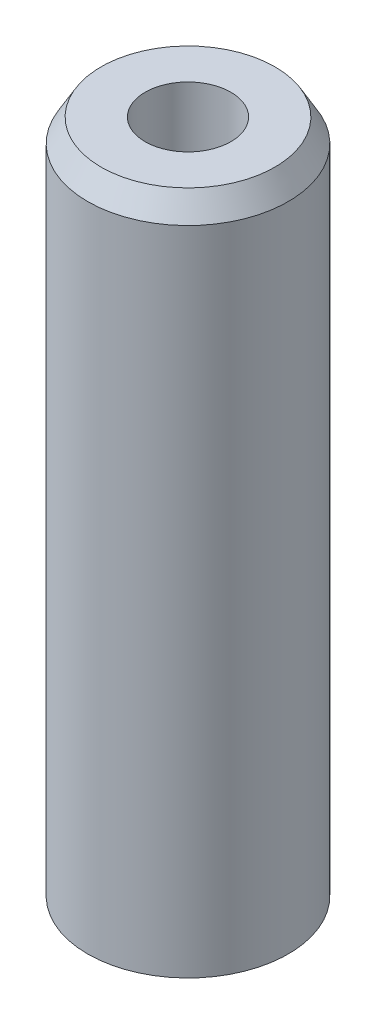
ISO-10303-21;
HEADER;
FILE_DESCRIPTION(('STEP AP214'),'2;1');
FILE_NAME('part.step','',(''),(''),'','','');
FILE_SCHEMA(('AUTOMOTIVE_DESIGN { 1 0 10303 214 1 1 1 1 }'));
ENDSEC;
DATA;
#1=APPLICATION_CONTEXT('core data for automotive mechanical design processes');
#2=APPLICATION_PROTOCOL_DEFINITION('international standard','automotive_design',2000,#1);
#3=PRODUCT_CONTEXT('',#1,'mechanical');
#4=PRODUCT('Part','Part','',(#3));
#5=PRODUCT_RELATED_PRODUCT_CATEGORY('part','',(#4));
#6=PRODUCT_DEFINITION_FORMATION('','',#4);
#7=PRODUCT_DEFINITION_CONTEXT('part definition',#1,'design');
#8=PRODUCT_DEFINITION('design','',#6,#7);
#9=PRODUCT_DEFINITION_SHAPE('','',#8);
#10=(LENGTH_UNIT() NAMED_UNIT(*) SI_UNIT(.MILLI.,.METRE.));
#11=(NAMED_UNIT(*) PLANE_ANGLE_UNIT() SI_UNIT($,.RADIAN.));
#12=(NAMED_UNIT(*) SI_UNIT($,.STERADIAN.) SOLID_ANGLE_UNIT());
#13=UNCERTAINTY_MEASURE_WITH_UNIT(LENGTH_MEASURE(1.E-05),#10,'distance_accuracy_value','');
#14=(GEOMETRIC_REPRESENTATION_CONTEXT(3) GLOBAL_UNCERTAINTY_ASSIGNED_CONTEXT((#13)) GLOBAL_UNIT_ASSIGNED_CONTEXT((#10,
#11,#12)) REPRESENTATION_CONTEXT('',''));
#15=CARTESIAN_POINT('',(0.,0.,0.));
#16=DIRECTION('',(0.,0.,1.));
#17=DIRECTION('',(1.,0.,0.));
#18=AXIS2_PLACEMENT_3D('',#15,#16,#17);
#19=CARTESIAN_POINT('',(0.,68.6098912815722,0.));
#20=DIRECTION('',(0.,-1.,0.));
#21=DIRECTION('',(0.,0.,-1.));
#22=AXIS2_PLACEMENT_3D('',#19,#20,#21);
#23=CYLINDRICAL_SURFACE('',#22,10.);
#24=CARTESIAN_POINT('',(0.,66.3017269703377,0.));
#25=DIRECTION('',(0.,1.,0.));
#26=DIRECTION('',(0.,0.,1.));
#27=AXIS2_PLACEMENT_3D('',#24,#25,#26);
#28=CIRCLE('',#27,10.);
#29=CARTESIAN_POINT('',(0.,66.3017269703377,10.));
#30=VERTEX_POINT('',#29);
#31=EDGE_CURVE('E50',#30,#30,#28,.F.);
#32=ORIENTED_EDGE('',*,*,#31,.T.);
#33=EDGE_LOOP('',(#32));
#34=FACE_BOUND('',#33,.T.);
#35=CARTESIAN_POINT('',(0.,1.33261928642511,0.));
#36=DIRECTION('',(0.,1.,0.));
#37=DIRECTION('',(0.,0.,1.));
#38=AXIS2_PLACEMENT_3D('',#35,#36,#37);
#39=CIRCLE('',#38,10.);
#40=CARTESIAN_POINT('',(0.,1.33261928642511,10.));
#41=VERTEX_POINT('',#40);
#42=EDGE_CURVE('E51',#41,#41,#39,.T.);
#43=ORIENTED_EDGE('',*,*,#42,.T.);
#44=EDGE_LOOP('',(#43));
#45=FACE_BOUND('',#44,.T.);
#46=ADVANCED_FACE('F39',(#34,#45),#23,.T.);
#47=CARTESIAN_POINT('',(0.,68.6098912815722,0.));
#48=DIRECTION('',(0.,1.,0.));
#49=DIRECTION('',(0.,0.,1.));
#50=AXIS2_PLACEMENT_3D('',#47,#48,#49);
#51=PLANE('',#50);
#52=CARTESIAN_POINT('',(0.,68.6098912815722,0.));
#53=DIRECTION('',(0.,1.,0.));
#54=DIRECTION('',(0.,0.,1.));
#55=AXIS2_PLACEMENT_3D('',#52,#53,#54);
#56=CIRCLE('',#55,8.66738071357488);
#57=CARTESIAN_POINT('',(0.,68.6098912815722,8.66738071357488));
#58=VERTEX_POINT('',#57);
#59=EDGE_CURVE('E54',#58,#58,#56,.T.);
#60=ORIENTED_EDGE('',*,*,#59,.T.);
#61=EDGE_LOOP('',(#60));
#62=FACE_BOUND('',#61,.T.);
#63=CARTESIAN_POINT('',(0.,68.6098912815722,0.));
#64=DIRECTION('',(0.,1.,0.));
#65=DIRECTION('',(0.,0.,1.));
#66=AXIS2_PLACEMENT_3D('',#63,#64,#65);
#67=CIRCLE('',#66,4.27527601353929);
#68=CARTESIAN_POINT('',(0.,68.6098912815722,4.27527601353929));
#69=VERTEX_POINT('',#68);
#70=EDGE_CURVE('E58',#69,#69,#67,.T.);
#71=ORIENTED_EDGE('',*,*,#70,.F.);
#72=EDGE_LOOP('',(#71));
#73=FACE_BOUND('',#72,.T.);
#74=ADVANCED_FACE('F69',(#62,#73),#51,.T.);
#75=CARTESIAN_POINT('',(0.,0.,0.));
#76=DIRECTION('',(0.,1.,0.));
#77=DIRECTION('',(0.,0.,1.));
#78=AXIS2_PLACEMENT_3D('',#75,#76,#77);
#79=PLANE('',#78);
#80=CARTESIAN_POINT('',(0.,0.,0.));
#81=DIRECTION('',(0.,1.,0.));
#82=DIRECTION('',(0.,0.,1.));
#83=AXIS2_PLACEMENT_3D('',#80,#81,#82);
#84=CIRCLE('',#83,7.69183568876549);
#85=CARTESIAN_POINT('',(0.,0.,7.69183568876549));
#86=VERTEX_POINT('',#85);
#87=EDGE_CURVE('E10',#86,#86,#84,.F.);
#88=ORIENTED_EDGE('',*,*,#87,.T.);
#89=EDGE_LOOP('',(#88));
#90=FACE_BOUND('',#89,.T.);
#91=CARTESIAN_POINT('',(0.,0.,0.));
#92=DIRECTION('',(0.,1.,0.));
#93=DIRECTION('',(0.,0.,1.));
#94=AXIS2_PLACEMENT_3D('',#91,#92,#93);
#95=CIRCLE('',#94,4.27527601353929);
#96=CARTESIAN_POINT('',(0.,0.,4.27527601353929));
#97=VERTEX_POINT('',#96);
#98=EDGE_CURVE('E63',#97,#97,#95,.T.);
#99=ORIENTED_EDGE('',*,*,#98,.T.);
#100=EDGE_LOOP('',(#99));
#101=FACE_BOUND('',#100,.T.);
#102=ADVANCED_FACE('F75',(#90,#101),#79,.F.);
#103=CARTESIAN_POINT('',(0.,68.6098912815722,0.));
#104=DIRECTION('',(0.,-1.,0.));
#105=DIRECTION('',(0.,0.,-1.));
#106=AXIS2_PLACEMENT_3D('',#103,#104,#105);
#107=CYLINDRICAL_SURFACE('',#106,4.27527601353929);
#108=ORIENTED_EDGE('',*,*,#70,.T.);
#109=EDGE_LOOP('',(#108));
#110=FACE_BOUND('',#109,.T.);
#111=ORIENTED_EDGE('',*,*,#98,.F.);
#112=EDGE_LOOP('',(#111));
#113=FACE_BOUND('',#112,.T.);
#114=ADVANCED_FACE('F70',(#110,#113),#107,.F.);
#115=CARTESIAN_POINT('',(0.,68.6098912815722,0.));
#116=DIRECTION('',(0.,-1.,0.));
#117=DIRECTION('',(0.,0.,-1.));
#118=AXIS2_PLACEMENT_3D('',#115,#116,#117);
#119=CONICAL_SURFACE('',#118,8.66738071357488,0.523598775598294);
#120=ORIENTED_EDGE('',*,*,#31,.F.);
#121=EDGE_LOOP('',(#120));
#122=FACE_BOUND('',#121,.T.);
#123=ORIENTED_EDGE('',*,*,#59,.F.);
#124=EDGE_LOOP('',(#123));
#125=FACE_BOUND('',#124,.T.);
#126=ADVANCED_FACE('F81',(#122,#125),#119,.T.);
#127=CARTESIAN_POINT('',(0.,1.33261928642511,0.));
#128=DIRECTION('',(0.,1.,0.));
#129=DIRECTION('',(0.,0.,1.));
#130=AXIS2_PLACEMENT_3D('',#127,#128,#129);
#131=CONICAL_SURFACE('',#130,10.,1.0471975511966);
#132=CARTESIAN_POINT('',(0.,0.,7.69183568876549));
#133=CARTESIAN_POINT('',(0.,0.0138814509002611,7.71587906700752));
#134=CARTESIAN_POINT('',(0.,0.0277629018005228,7.73992244524954));
#135=CARTESIAN_POINT('',(0.,0.0555258036010462,7.78800920173359));
#136=CARTESIAN_POINT('',(0.,0.0694072545013079,7.81205257997562));
#137=CARTESIAN_POINT('',(0.,0.0971701563018311,7.86013933645967));
#138=CARTESIAN_POINT('',(0.,0.111051607202093,7.8841827147017));
#139=CARTESIAN_POINT('',(0.,0.138814509002616,7.93226947118575));
#140=CARTESIAN_POINT('',(0.,0.152695959902877,7.95631284942778));
#141=CARTESIAN_POINT('',(0.,0.1804588617034,8.00439960591183));
#142=CARTESIAN_POINT('',(0.,0.194340312603662,8.02844298415386));
#143=CARTESIAN_POINT('',(0.,0.222103214404185,8.07652974063791));
#144=CARTESIAN_POINT('',(0.,0.235984665304447,8.10057311887993));
#145=CARTESIAN_POINT('',(0.,0.26374756710497,8.14865987536399));
#146=CARTESIAN_POINT('',(0.,0.277629018005232,8.17270325360601));
#147=CARTESIAN_POINT('',(0.,0.305391919805755,8.22079001009006));
#148=CARTESIAN_POINT('',(0.,0.319273370706017,8.24483338833209));
#149=CARTESIAN_POINT('',(0.,0.34703627250654,8.29292014481614));
#150=CARTESIAN_POINT('',(0.,0.360917723406801,8.31696352305817));
#151=CARTESIAN_POINT('',(0.,0.388680625207324,8.36505027954222));
#152=CARTESIAN_POINT('',(0.,0.402562076107586,8.38909365778425));
#153=CARTESIAN_POINT('',(0.,0.430324977908109,8.4371804142683));
#154=CARTESIAN_POINT('',(0.,0.444206428808371,8.46122379251033));
#155=CARTESIAN_POINT('',(0.,0.471969330608894,8.50931054899438));
#156=CARTESIAN_POINT('',(0.,0.485850781509156,8.5333539272364));
#157=CARTESIAN_POINT('',(0.,0.513613683309679,8.58144068372046));
#158=CARTESIAN_POINT('',(0.,0.52749513420994,8.60548406196248));
#159=CARTESIAN_POINT('',(0.,0.555258036010464,8.65357081844654));
#160=CARTESIAN_POINT('',(0.,0.569139486910725,8.67761419668856));
#161=CARTESIAN_POINT('',(0.,0.596902388711249,8.72570095317261));
#162=CARTESIAN_POINT('',(0.,0.61078383961151,8.74974433141464));
#163=CARTESIAN_POINT('',(0.,0.638546741412033,8.79783108789869));
#164=CARTESIAN_POINT('',(0.,0.652428192312295,8.82187446614072));
#165=CARTESIAN_POINT('',(0.,0.680191094112818,8.86996122262477));
#166=CARTESIAN_POINT('',(0.,0.694072545013079,8.8940046008668));
#167=CARTESIAN_POINT('',(0.,0.721835446813603,8.94209135735085));
#168=CARTESIAN_POINT('',(0.,0.735716897713865,8.96613473559288));
#169=CARTESIAN_POINT('',(0.,0.763479799514388,9.01422149207693));
#170=CARTESIAN_POINT('',(0.,0.777361250414649,9.03826487031895));
#171=CARTESIAN_POINT('',(0.,0.805124152215172,9.08635162680301));
#172=CARTESIAN_POINT('',(0.,0.819005603115434,9.11039500504503));
#173=CARTESIAN_POINT('',(0.,0.846768504915957,9.15848176152908));
#174=CARTESIAN_POINT('',(0.,0.860649955816219,9.18252513977111));
#175=CARTESIAN_POINT('',(0.,0.888412857616742,9.23061189625516));
#176=CARTESIAN_POINT('',(0.,0.902294308517004,9.25465527449719));
#177=CARTESIAN_POINT('',(0.,0.930057210317527,9.30274203098124));
#178=CARTESIAN_POINT('',(0.,0.943938661217788,9.32678540922327));
#179=CARTESIAN_POINT('',(0.,0.971701563018311,9.37487216570732));
#180=CARTESIAN_POINT('',(0.,0.985583013918573,9.39891554394935));
#181=CARTESIAN_POINT('',(0.,1.0133459157191,9.4470023004334));
#182=CARTESIAN_POINT('',(0.,1.02722736661936,9.47104567867543));
#183=CARTESIAN_POINT('',(0.,1.05499026841988,9.51913243515948));
#184=CARTESIAN_POINT('',(0.,1.06887171932014,9.5431758134015));
#185=CARTESIAN_POINT('',(0.,1.09663462112067,9.59126256988555));
#186=CARTESIAN_POINT('',(0.,1.11051607202093,9.61530594812758));
#187=CARTESIAN_POINT('',(0.,1.13827897382145,9.66339270461163));
#188=CARTESIAN_POINT('',(0.,1.15216042472171,9.68743608285366));
#189=CARTESIAN_POINT('',(0.,1.17992332652224,9.73552283933771));
#190=CARTESIAN_POINT('',(0.,1.1938047774225,9.75956621757974));
#191=CARTESIAN_POINT('',(0.,1.22156767922302,9.80765297406379));
#192=CARTESIAN_POINT('',(0.,1.23544913012328,9.83169635230582));
#193=CARTESIAN_POINT('',(0.,1.26321203192381,9.87978310878987));
#194=CARTESIAN_POINT('',(0.,1.27709348282407,9.9038264870319));
#195=CARTESIAN_POINT('',(0.,1.30485638462459,9.95191324351595));
#196=CARTESIAN_POINT('',(0.,1.31873783552485,9.97595662175797));
#197=CARTESIAN_POINT('',(0.,1.33261928642511,10.));
#198=B_SPLINE_CURVE_WITH_KNOTS('',3,(#132,#133,#134,#135,#136,#137,#138,#139,#140,#141,#142,
#143,#144,#145,#146,#147,#148,#149,#150,#151,#152,#153,#154,#155,#156,#157,#158,#159,#160,#161,
#162,#163,#164,#165,#166,#167,#168,#169,#170,#171,#172,#173,#174,#175,#176,#177,#178,#179,#180,
#181,#182,#183,#184,#185,#186,#187,#188,#189,#190,#191,#192,#193,#194,#195,#196,#197),
.UNSPECIFIED.,.F.,.F.,(4,2,2,2,2,2,2,2,2,2,2,2,2,2,2,2,2,2,2,2,2,2,2,2,2,2,2,2,2,2,2,2,4),(0.,
0.0832887054015705,0.16657741080314,0.249866116204711,0.333154821606283,0.416443527007852,
0.499732232409422,0.583020937810993,0.666309643212563,0.749598348614134,0.832887054015704,
0.916175759417275,0.999464464818845,1.08275317022042,1.16604187562199,1.24933058102356,
1.33261928642513,1.4159079918267,1.49919669722827,1.58248540262984,1.66577410803141,
1.74906281343298,1.83235151883455,1.91564022423612,1.99892892963769,2.08221763503926,
2.16550634044083,2.2487950458424,2.33208375124397,2.41537245664554,2.49866116204711,
2.58194986744869,2.66523857285025),.UNSPECIFIED.);
#199=EDGE_CURVE('BSEAM45',#86,#41,#198,.T.);
#200=ORIENTED_EDGE('',*,*,#87,.F.);
#201=ORIENTED_EDGE('',*,*,#42,.F.);
#202=ORIENTED_EDGE('',*,*,#199,.T.);
#203=ORIENTED_EDGE('',*,*,#199,.F.);
#204=EDGE_LOOP('',(#200,#202,#201,#203));
#205=FACE_BOUND('',#204,.T.);
#206=ADVANCED_FACE('F45',(#205),#131,.T.);
#207=CLOSED_SHELL('',(#46,#74,#102,#114,#126,#206));
#208=MANIFOLD_SOLID_BREP('B2',#207);
#209=ADVANCED_BREP_SHAPE_REPRESENTATION('',(#18,#208),#14);
#210=SHAPE_DEFINITION_REPRESENTATION(#9,#209);
ENDSEC;
END-ISO-10303-21;
